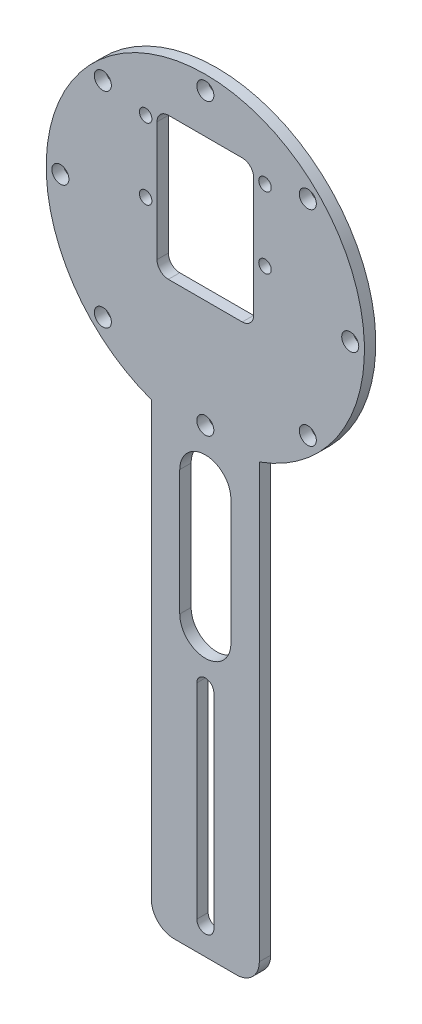
ISO-10303-21;
HEADER;
FILE_DESCRIPTION(('STEP AP214'),'2;1');
FILE_NAME('part.step','',(''),(''),'','','');
FILE_SCHEMA(('AUTOMOTIVE_DESIGN { 1 0 10303 214 1 1 1 1 }'));
ENDSEC;
DATA;
#1=APPLICATION_CONTEXT('core data for automotive mechanical design processes');
#2=APPLICATION_PROTOCOL_DEFINITION('international standard','automotive_design',2000,#1);
#3=PRODUCT_CONTEXT('',#1,'mechanical');
#4=PRODUCT('Part','Part','',(#3));
#5=PRODUCT_RELATED_PRODUCT_CATEGORY('part','',(#4));
#6=PRODUCT_DEFINITION_FORMATION('','',#4);
#7=PRODUCT_DEFINITION_CONTEXT('part definition',#1,'design');
#8=PRODUCT_DEFINITION('design','',#6,#7);
#9=PRODUCT_DEFINITION_SHAPE('','',#8);
#10=(LENGTH_UNIT() NAMED_UNIT(*) SI_UNIT(.MILLI.,.METRE.));
#11=(NAMED_UNIT(*) PLANE_ANGLE_UNIT() SI_UNIT($,.RADIAN.));
#12=(NAMED_UNIT(*) SI_UNIT($,.STERADIAN.) SOLID_ANGLE_UNIT());
#13=UNCERTAINTY_MEASURE_WITH_UNIT(LENGTH_MEASURE(1.E-05),#10,'distance_accuracy_value','');
#14=(GEOMETRIC_REPRESENTATION_CONTEXT(3) GLOBAL_UNCERTAINTY_ASSIGNED_CONTEXT((#13)) GLOBAL_UNIT_ASSIGNED_CONTEXT((#10,
#11,#12)) REPRESENTATION_CONTEXT('',''));
#15=CARTESIAN_POINT('',(0.,0.,0.));
#16=DIRECTION('',(0.,0.,1.));
#17=DIRECTION('',(1.,0.,0.));
#18=AXIS2_PLACEMENT_3D('',#15,#16,#17);
#19=CARTESIAN_POINT('',(0.,106.5,2.));
#20=DIRECTION('',(0.,0.,1.));
#21=DIRECTION('',(1.,0.,0.));
#22=AXIS2_PLACEMENT_3D('',#19,#20,#21);
#23=PLANE('',#22);
#24=CARTESIAN_POINT('',(0.,41.,2.));
#25=DIRECTION('',(0.,0.,1.));
#26=DIRECTION('',(1.,0.,0.));
#27=AXIS2_PLACEMENT_3D('',#24,#25,#26);
#28=CIRCLE('',#27,1.5);
#29=CARTESIAN_POINT('',(1.5,41.,2.));
#30=VERTEX_POINT('',#29);
#31=CARTESIAN_POINT('',(-1.5,41.,2.));
#32=VERTEX_POINT('',#31);
#33=EDGE_CURVE('E191',#30,#32,#28,.T.);
#34=ORIENTED_EDGE('',*,*,#33,.F.);
#35=DIRECTION('',(0.,1.,0.));
#36=VECTOR('',#35,1.);
#37=CARTESIAN_POINT('',(1.5,41.,2.));
#38=LINE('',#37,#36);
#39=CARTESIAN_POINT('',(1.5,5.,2.));
#40=VERTEX_POINT('',#39);
#41=EDGE_CURVE('E209',#40,#30,#38,.T.);
#42=ORIENTED_EDGE('',*,*,#41,.F.);
#43=CARTESIAN_POINT('',(0.,5.,2.));
#44=DIRECTION('',(0.,0.,1.));
#45=DIRECTION('',(1.,0.,0.));
#46=AXIS2_PLACEMENT_3D('',#43,#44,#45);
#47=CIRCLE('',#46,1.5);
#48=CARTESIAN_POINT('',(-1.5,5.,2.));
#49=VERTEX_POINT('',#48);
#50=EDGE_CURVE('E212',#49,#40,#47,.T.);
#51=ORIENTED_EDGE('',*,*,#50,.F.);
#52=DIRECTION('',(0.,-1.,0.));
#53=VECTOR('',#52,1.);
#54=CARTESIAN_POINT('',(-1.5,41.,2.));
#55=LINE('',#54,#53);
#56=EDGE_CURVE('E218',#32,#49,#55,.T.);
#57=ORIENTED_EDGE('',*,*,#56,.F.);
#58=EDGE_LOOP('',(#34,#42,#51,#57));
#59=FACE_BOUND('',#58,.T.);
#60=CARTESIAN_POINT('',(0.,72.,2.));
#61=DIRECTION('',(0.,0.,1.));
#62=DIRECTION('',(1.,0.,0.));
#63=AXIS2_PLACEMENT_3D('',#60,#61,#62);
#64=CIRCLE('',#63,4.50000000000001);
#65=CARTESIAN_POINT('',(4.50000000000001,72.,2.));
#66=VERTEX_POINT('',#65);
#67=CARTESIAN_POINT('',(-4.50000000000001,72.,2.));
#68=VERTEX_POINT('',#67);
#69=EDGE_CURVE('E224',#66,#68,#64,.T.);
#70=ORIENTED_EDGE('',*,*,#69,.F.);
#71=DIRECTION('',(0.,1.,0.));
#72=VECTOR('',#71,1.);
#73=CARTESIAN_POINT('',(4.50000000000001,72.,2.));
#74=LINE('',#73,#72);
#75=CARTESIAN_POINT('',(4.50000000000002,50.,2.));
#76=VERTEX_POINT('',#75);
#77=EDGE_CURVE('E232',#76,#66,#74,.T.);
#78=ORIENTED_EDGE('',*,*,#77,.F.);
#79=CARTESIAN_POINT('',(0.,50.,2.));
#80=DIRECTION('',(0.,0.,1.));
#81=DIRECTION('',(1.,0.,0.));
#82=AXIS2_PLACEMENT_3D('',#79,#80,#81);
#83=CIRCLE('',#82,4.50000000000001);
#84=CARTESIAN_POINT('',(-4.50000000000001,50.,2.));
#85=VERTEX_POINT('',#84);
#86=EDGE_CURVE('E246',#85,#76,#83,.T.);
#87=ORIENTED_EDGE('',*,*,#86,.F.);
#88=DIRECTION('',(0.,-1.,0.));
#89=VECTOR('',#88,1.);
#90=CARTESIAN_POINT('',(-4.50000000000001,72.,2.));
#91=LINE('',#90,#89);
#92=EDGE_CURVE('E243',#68,#85,#91,.T.);
#93=ORIENTED_EDGE('',*,*,#92,.F.);
#94=EDGE_LOOP('',(#70,#78,#87,#93));
#95=FACE_BOUND('',#94,.T.);
#96=CARTESIAN_POINT('',(-25.4999999999993,106.499999999999,2.));
#97=DIRECTION('',(0.,0.,1.));
#98=DIRECTION('',(1.,0.,0.));
#99=AXIS2_PLACEMENT_3D('',#96,#97,#98);
#100=CIRCLE('',#99,1.49999999999999);
#101=CARTESIAN_POINT('',(-23.9999999999993,106.499999999999,2.));
#102=VERTEX_POINT('',#101);
#103=EDGE_CURVE('E266',#102,#102,#100,.T.);
#104=ORIENTED_EDGE('',*,*,#103,.F.);
#105=EDGE_LOOP('',(#104));
#106=FACE_BOUND('',#105,.T.);
#107=CARTESIAN_POINT('',(1.38678545745389E-12,81.,2.));
#108=DIRECTION('',(0.,0.,1.));
#109=DIRECTION('',(1.,0.,0.));
#110=AXIS2_PLACEMENT_3D('',#107,#108,#109);
#111=CIRCLE('',#110,1.5);
#112=CARTESIAN_POINT('',(1.50000000000139,81.,2.));
#113=VERTEX_POINT('',#112);
#114=EDGE_CURVE('E278',#113,#113,#111,.T.);
#115=ORIENTED_EDGE('',*,*,#114,.F.);
#116=EDGE_LOOP('',(#115));
#117=FACE_BOUND('',#116,.T.);
#118=CARTESIAN_POINT('',(10.5,123.,2.));
#119=DIRECTION('',(0.,0.,1.));
#120=DIRECTION('',(-1.,0.,0.));
#121=AXIS2_PLACEMENT_3D('',#118,#119,#120);
#122=CIRCLE('',#121,1.10000000000001);
#123=CARTESIAN_POINT('',(9.39999999999999,123.,2.));
#124=VERTEX_POINT('',#123);
#125=EDGE_CURVE('E290',#124,#124,#122,.T.);
#126=ORIENTED_EDGE('',*,*,#125,.F.);
#127=EDGE_LOOP('',(#126));
#128=FACE_BOUND('',#127,.T.);
#129=CARTESIAN_POINT('',(-10.5,110.5,2.));
#130=DIRECTION('',(0.,0.,1.));
#131=DIRECTION('',(1.,0.,0.));
#132=AXIS2_PLACEMENT_3D('',#129,#130,#131);
#133=CIRCLE('',#132,1.10000000000001);
#134=CARTESIAN_POINT('',(-9.39999999999999,110.5,2.));
#135=VERTEX_POINT('',#134);
#136=EDGE_CURVE('E302',#135,#135,#133,.T.);
#137=ORIENTED_EDGE('',*,*,#136,.F.);
#138=EDGE_LOOP('',(#137));
#139=FACE_BOUND('',#138,.T.);
#140=CARTESIAN_POINT('',(25.5000000000007,106.500000000001,2.));
#141=DIRECTION('',(0.,0.,1.));
#142=DIRECTION('',(1.,0.,0.));
#143=AXIS2_PLACEMENT_3D('',#140,#141,#142);
#144=CIRCLE('',#143,1.5);
#145=CARTESIAN_POINT('',(27.0000000000007,106.500000000001,2.));
#146=VERTEX_POINT('',#145);
#147=EDGE_CURVE('E314',#146,#146,#144,.T.);
#148=ORIENTED_EDGE('',*,*,#147,.F.);
#149=EDGE_LOOP('',(#148));
#150=FACE_BOUND('',#149,.T.);
#151=CARTESIAN_POINT('',(0.,132.,2.));
#152=DIRECTION('',(0.,0.,1.));
#153=DIRECTION('',(1.,0.,0.));
#154=AXIS2_PLACEMENT_3D('',#151,#152,#153);
#155=CIRCLE('',#154,1.5);
#156=CARTESIAN_POINT('',(1.5,132.,2.));
#157=VERTEX_POINT('',#156);
#158=EDGE_CURVE('E326',#157,#157,#155,.T.);
#159=ORIENTED_EDGE('',*,*,#158,.F.);
#160=EDGE_LOOP('',(#159));
#161=FACE_BOUND('',#160,.T.);
#162=DIRECTION('',(0.,-1.,0.));
#163=VECTOR('',#162,1.);
#164=CARTESIAN_POINT('',(-9.5,80.1608656178682,2.));
#165=LINE('',#164,#163);
#166=CARTESIAN_POINT('',(-9.5,80.1608656178682,2.));
#167=VERTEX_POINT('',#166);
#168=CARTESIAN_POINT('',(-9.50000000000001,4.,2.));
#169=VERTEX_POINT('',#168);
#170=EDGE_CURVE('E359',#167,#169,#165,.T.);
#171=ORIENTED_EDGE('',*,*,#170,.T.);
#172=CARTESIAN_POINT('',(-5.50000000000001,4.,2.));
#173=DIRECTION('',(0.,0.,1.));
#174=DIRECTION('',(1.,0.,0.));
#175=AXIS2_PLACEMENT_3D('',#172,#173,#174);
#176=CIRCLE('',#175,4.);
#177=CARTESIAN_POINT('',(-5.50000000000001,0.,2.));
#178=VERTEX_POINT('',#177);
#179=EDGE_CURVE('E41',#169,#178,#176,.T.);
#180=ORIENTED_EDGE('',*,*,#179,.T.);
#181=DIRECTION('',(1.,0.,0.));
#182=VECTOR('',#181,1.);
#183=CARTESIAN_POINT('',(9.50000000000001,0.,2.));
#184=LINE('',#183,#182);
#185=CARTESIAN_POINT('',(5.50000000000001,0.,2.));
#186=VERTEX_POINT('',#185);
#187=EDGE_CURVE('E362',#178,#186,#184,.T.);
#188=ORIENTED_EDGE('',*,*,#187,.T.);
#189=CARTESIAN_POINT('',(5.50000000000001,4.,2.));
#190=DIRECTION('',(0.,0.,1.));
#191=DIRECTION('',(1.,0.,0.));
#192=AXIS2_PLACEMENT_3D('',#189,#190,#191);
#193=CIRCLE('',#192,4.);
#194=CARTESIAN_POINT('',(9.50000000000001,4.,2.));
#195=VERTEX_POINT('',#194);
#196=EDGE_CURVE('E48',#186,#195,#193,.T.);
#197=ORIENTED_EDGE('',*,*,#196,.T.);
#198=DIRECTION('',(0.,1.,0.));
#199=VECTOR('',#198,1.);
#200=CARTESIAN_POINT('',(9.5,80.1608656178682,2.));
#201=LINE('',#200,#199);
#202=CARTESIAN_POINT('',(9.5,80.1608656178682,2.));
#203=VERTEX_POINT('',#202);
#204=EDGE_CURVE('E364',#195,#203,#201,.T.);
#205=ORIENTED_EDGE('',*,*,#204,.T.);
#206=CARTESIAN_POINT('',(0.,106.5,2.));
#207=DIRECTION('',(0.,0.,1.));
#208=DIRECTION('',(1.,0.,0.));
#209=AXIS2_PLACEMENT_3D('',#206,#207,#208);
#210=CIRCLE('',#209,28.);
#211=EDGE_CURVE('E356',#203,#167,#210,.T.);
#212=ORIENTED_EDGE('',*,*,#211,.T.);
#213=EDGE_LOOP('',(#171,#180,#188,#197,#205,#212));
#214=FACE_BOUND('',#213,.T.);
#215=DIRECTION('',(1.,0.,0.));
#216=VECTOR('',#215,1.);
#217=CARTESIAN_POINT('',(8.5,100.,2.));
#218=LINE('',#217,#216);
#219=CARTESIAN_POINT('',(-6.5,100.,2.));
#220=VERTEX_POINT('',#219);
#221=CARTESIAN_POINT('',(6.5,100.,2.));
#222=VERTEX_POINT('',#221);
#223=EDGE_CURVE('E335',#220,#222,#218,.T.);
#224=ORIENTED_EDGE('',*,*,#223,.F.);
#225=CARTESIAN_POINT('',(-6.5,102.,2.));
#226=DIRECTION('',(0.,0.,1.));
#227=DIRECTION('',(1.,0.,0.));
#228=AXIS2_PLACEMENT_3D('',#225,#226,#227);
#229=CIRCLE('',#228,2.);
#230=CARTESIAN_POINT('',(-8.5,102.,2.));
#231=VERTEX_POINT('',#230);
#232=EDGE_CURVE('E410',#220,#231,#229,.F.);
#233=ORIENTED_EDGE('',*,*,#232,.T.);
#234=DIRECTION('',(0.,-1.,0.));
#235=VECTOR('',#234,1.);
#236=CARTESIAN_POINT('',(-8.5,100.,2.));
#237=LINE('',#236,#235);
#238=CARTESIAN_POINT('',(-8.5,123.,2.));
#239=VERTEX_POINT('',#238);
#240=EDGE_CURVE('E332',#239,#231,#237,.T.);
#241=ORIENTED_EDGE('',*,*,#240,.F.);
#242=CARTESIAN_POINT('',(-6.5,123.,2.));
#243=DIRECTION('',(0.,0.,1.));
#244=DIRECTION('',(1.,0.,0.));
#245=AXIS2_PLACEMENT_3D('',#242,#243,#244);
#246=CIRCLE('',#245,2.);
#247=CARTESIAN_POINT('',(-6.5,125.,2.));
#248=VERTEX_POINT('',#247);
#249=EDGE_CURVE('E406',#239,#248,#246,.F.);
#250=ORIENTED_EDGE('',*,*,#249,.T.);
#251=DIRECTION('',(-1.,0.,0.));
#252=VECTOR('',#251,1.);
#253=CARTESIAN_POINT('',(-8.5,125.,2.));
#254=LINE('',#253,#252);
#255=CARTESIAN_POINT('',(6.5,125.,2.));
#256=VERTEX_POINT('',#255);
#257=EDGE_CURVE('E342',#256,#248,#254,.T.);
#258=ORIENTED_EDGE('',*,*,#257,.F.);
#259=CARTESIAN_POINT('',(6.5,123.,2.));
#260=DIRECTION('',(0.,0.,1.));
#261=DIRECTION('',(1.,0.,0.));
#262=AXIS2_PLACEMENT_3D('',#259,#260,#261);
#263=CIRCLE('',#262,2.);
#264=CARTESIAN_POINT('',(8.5,123.,2.));
#265=VERTEX_POINT('',#264);
#266=EDGE_CURVE('E402',#256,#265,#263,.F.);
#267=ORIENTED_EDGE('',*,*,#266,.T.);
#268=DIRECTION('',(0.,1.,0.));
#269=VECTOR('',#268,1.);
#270=CARTESIAN_POINT('',(8.5,100.,2.));
#271=LINE('',#270,#269);
#272=CARTESIAN_POINT('',(8.5,102.,2.));
#273=VERTEX_POINT('',#272);
#274=EDGE_CURVE('E339',#273,#265,#271,.T.);
#275=ORIENTED_EDGE('',*,*,#274,.F.);
#276=CARTESIAN_POINT('',(6.5,102.,2.));
#277=DIRECTION('',(0.,0.,1.));
#278=DIRECTION('',(1.,0.,0.));
#279=AXIS2_PLACEMENT_3D('',#276,#277,#278);
#280=CIRCLE('',#279,2.);
#281=EDGE_CURVE('E414',#273,#222,#280,.F.);
#282=ORIENTED_EDGE('',*,*,#281,.T.);
#283=EDGE_LOOP('',(#224,#233,#241,#250,#258,#267,#275,#282));
#284=FACE_BOUND('',#283,.T.);
#285=CARTESIAN_POINT('',(18.0312229202572,124.531222920257,2.));
#286=DIRECTION('',(0.,0.,1.));
#287=DIRECTION('',(1.,0.,0.));
#288=AXIS2_PLACEMENT_3D('',#285,#286,#287);
#289=CIRCLE('',#288,1.50000000000001);
#290=CARTESIAN_POINT('',(19.5312229202572,124.531222920257,2.));
#291=VERTEX_POINT('',#290);
#292=EDGE_CURVE('E320',#291,#291,#289,.T.);
#293=ORIENTED_EDGE('',*,*,#292,.F.);
#294=EDGE_LOOP('',(#293));
#295=FACE_BOUND('',#294,.T.);
#296=CARTESIAN_POINT('',(-10.5,123.,2.));
#297=DIRECTION('',(0.,0.,1.));
#298=DIRECTION('',(1.,0.,0.));
#299=AXIS2_PLACEMENT_3D('',#296,#297,#298);
#300=CIRCLE('',#299,1.10000000000001);
#301=CARTESIAN_POINT('',(-9.39999999999999,123.,2.));
#302=VERTEX_POINT('',#301);
#303=EDGE_CURVE('E308',#302,#302,#300,.T.);
#304=ORIENTED_EDGE('',*,*,#303,.F.);
#305=EDGE_LOOP('',(#304));
#306=FACE_BOUND('',#305,.T.);
#307=CARTESIAN_POINT('',(10.5,110.5,2.));
#308=DIRECTION('',(0.,0.,1.));
#309=DIRECTION('',(-1.,0.,0.));
#310=AXIS2_PLACEMENT_3D('',#307,#308,#309);
#311=CIRCLE('',#310,1.10000000000001);
#312=CARTESIAN_POINT('',(9.39999999999999,110.5,2.));
#313=VERTEX_POINT('',#312);
#314=EDGE_CURVE('E296',#313,#313,#311,.T.);
#315=ORIENTED_EDGE('',*,*,#314,.F.);
#316=EDGE_LOOP('',(#315));
#317=FACE_BOUND('',#316,.T.);
#318=CARTESIAN_POINT('',(18.0312229202581,88.4687770797435,2.));
#319=DIRECTION('',(0.,0.,1.));
#320=DIRECTION('',(1.,0.,0.));
#321=AXIS2_PLACEMENT_3D('',#318,#319,#320);
#322=CIRCLE('',#321,1.5);
#323=CARTESIAN_POINT('',(19.5312229202581,88.4687770797435,2.));
#324=VERTEX_POINT('',#323);
#325=EDGE_CURVE('E284',#324,#324,#322,.T.);
#326=ORIENTED_EDGE('',*,*,#325,.F.);
#327=EDGE_LOOP('',(#326));
#328=FACE_BOUND('',#327,.T.);
#329=CARTESIAN_POINT('',(-18.0312229202558,88.4687770797425,2.));
#330=DIRECTION('',(0.,0.,1.));
#331=DIRECTION('',(1.,0.,0.));
#332=AXIS2_PLACEMENT_3D('',#329,#330,#331);
#333=CIRCLE('',#332,1.5);
#334=CARTESIAN_POINT('',(-16.5312229202558,88.4687770797425,2.));
#335=VERTEX_POINT('',#334);
#336=EDGE_CURVE('E272',#335,#335,#333,.T.);
#337=ORIENTED_EDGE('',*,*,#336,.F.);
#338=EDGE_LOOP('',(#337));
#339=FACE_BOUND('',#338,.T.);
#340=CARTESIAN_POINT('',(-18.0312229202568,124.531222920256,2.));
#341=DIRECTION('',(0.,0.,1.));
#342=DIRECTION('',(1.,0.,0.));
#343=AXIS2_PLACEMENT_3D('',#340,#341,#342);
#344=CIRCLE('',#343,1.5);
#345=CARTESIAN_POINT('',(-16.5312229202568,124.531222920256,2.));
#346=VERTEX_POINT('',#345);
#347=EDGE_CURVE('E260',#346,#346,#344,.T.);
#348=ORIENTED_EDGE('',*,*,#347,.F.);
#349=EDGE_LOOP('',(#348));
#350=FACE_BOUND('',#349,.T.);
#351=ADVANCED_FACE('F33',(#59,#95,#106,#117,#128,#139,#150,#161,#214,#284,#295,#306,#317,#328,
#339,#350),#23,.T.);
#352=CARTESIAN_POINT('',(0.,106.5,0.));
#353=DIRECTION('',(0.,0.,1.));
#354=DIRECTION('',(1.,0.,0.));
#355=AXIS2_PLACEMENT_3D('',#352,#353,#354);
#356=PLANE('',#355);
#357=DIRECTION('',(0.,1.,0.));
#358=VECTOR('',#357,1.);
#359=CARTESIAN_POINT('',(1.5,41.,0.));
#360=LINE('',#359,#358);
#361=CARTESIAN_POINT('',(1.5,5.,0.));
#362=VERTEX_POINT('',#361);
#363=CARTESIAN_POINT('',(1.5,41.,0.));
#364=VERTEX_POINT('',#363);
#365=EDGE_CURVE('E196',#362,#364,#360,.T.);
#366=ORIENTED_EDGE('',*,*,#365,.T.);
#367=CARTESIAN_POINT('',(0.,41.,0.));
#368=DIRECTION('',(0.,0.,1.));
#369=DIRECTION('',(1.,0.,0.));
#370=AXIS2_PLACEMENT_3D('',#367,#368,#369);
#371=CIRCLE('',#370,1.5);
#372=CARTESIAN_POINT('',(-1.5,41.,0.));
#373=VERTEX_POINT('',#372);
#374=EDGE_CURVE('E188',#364,#373,#371,.T.);
#375=ORIENTED_EDGE('',*,*,#374,.T.);
#376=DIRECTION('',(0.,-1.,0.));
#377=VECTOR('',#376,1.);
#378=CARTESIAN_POINT('',(-1.5,41.,0.));
#379=LINE('',#378,#377);
#380=CARTESIAN_POINT('',(-1.5,5.,0.));
#381=VERTEX_POINT('',#380);
#382=EDGE_CURVE('E200',#373,#381,#379,.T.);
#383=ORIENTED_EDGE('',*,*,#382,.T.);
#384=CARTESIAN_POINT('',(0.,5.,0.));
#385=DIRECTION('',(0.,0.,1.));
#386=DIRECTION('',(1.,0.,0.));
#387=AXIS2_PLACEMENT_3D('',#384,#385,#386);
#388=CIRCLE('',#387,1.5);
#389=EDGE_CURVE('E204',#381,#362,#388,.T.);
#390=ORIENTED_EDGE('',*,*,#389,.T.);
#391=EDGE_LOOP('',(#366,#375,#383,#390));
#392=FACE_BOUND('',#391,.T.);
#393=DIRECTION('',(0.,1.,0.));
#394=VECTOR('',#393,1.);
#395=CARTESIAN_POINT('',(4.50000000000001,72.,0.));
#396=LINE('',#395,#394);
#397=CARTESIAN_POINT('',(4.50000000000002,50.,0.));
#398=VERTEX_POINT('',#397);
#399=CARTESIAN_POINT('',(4.50000000000001,72.,0.));
#400=VERTEX_POINT('',#399);
#401=EDGE_CURVE('E238',#398,#400,#396,.T.);
#402=ORIENTED_EDGE('',*,*,#401,.T.);
#403=CARTESIAN_POINT('',(0.,72.,0.));
#404=DIRECTION('',(0.,0.,1.));
#405=DIRECTION('',(1.,0.,0.));
#406=AXIS2_PLACEMENT_3D('',#403,#404,#405);
#407=CIRCLE('',#406,4.50000000000001);
#408=CARTESIAN_POINT('',(-4.50000000000001,72.,0.));
#409=VERTEX_POINT('',#408);
#410=EDGE_CURVE('E228',#400,#409,#407,.T.);
#411=ORIENTED_EDGE('',*,*,#410,.T.);
#412=DIRECTION('',(0.,-1.,0.));
#413=VECTOR('',#412,1.);
#414=CARTESIAN_POINT('',(-4.50000000000001,72.,0.));
#415=LINE('',#414,#413);
#416=CARTESIAN_POINT('',(-4.50000000000001,50.,0.));
#417=VERTEX_POINT('',#416);
#418=EDGE_CURVE('E231',#409,#417,#415,.T.);
#419=ORIENTED_EDGE('',*,*,#418,.T.);
#420=CARTESIAN_POINT('',(0.,50.,0.));
#421=DIRECTION('',(0.,0.,1.));
#422=DIRECTION('',(1.,0.,0.));
#423=AXIS2_PLACEMENT_3D('',#420,#421,#422);
#424=CIRCLE('',#423,4.50000000000001);
#425=EDGE_CURVE('E235',#417,#398,#424,.T.);
#426=ORIENTED_EDGE('',*,*,#425,.T.);
#427=EDGE_LOOP('',(#402,#411,#419,#426));
#428=FACE_BOUND('',#427,.T.);
#429=DIRECTION('',(1.,0.,0.));
#430=VECTOR('',#429,1.);
#431=CARTESIAN_POINT('',(9.50000000000001,0.,0.));
#432=LINE('',#431,#430);
#433=CARTESIAN_POINT('',(-5.50000000000001,0.,0.));
#434=VERTEX_POINT('',#433);
#435=CARTESIAN_POINT('',(5.50000000000001,0.,0.));
#436=VERTEX_POINT('',#435);
#437=EDGE_CURVE('E371',#434,#436,#432,.T.);
#438=ORIENTED_EDGE('',*,*,#437,.F.);
#439=CARTESIAN_POINT('',(-5.50000000000001,4.,0.));
#440=DIRECTION('',(0.,0.,1.));
#441=DIRECTION('',(1.,0.,0.));
#442=AXIS2_PLACEMENT_3D('',#439,#440,#441);
#443=CIRCLE('',#442,4.);
#444=CARTESIAN_POINT('',(-9.50000000000001,4.,0.));
#445=VERTEX_POINT('',#444);
#446=EDGE_CURVE('E423',#434,#445,#443,.F.);
#447=ORIENTED_EDGE('',*,*,#446,.T.);
#448=DIRECTION('',(0.,-1.,0.));
#449=VECTOR('',#448,1.);
#450=CARTESIAN_POINT('',(-9.5,80.1608656178682,0.));
#451=LINE('',#450,#449);
#452=CARTESIAN_POINT('',(-9.5,80.1608656178682,0.));
#453=VERTEX_POINT('',#452);
#454=EDGE_CURVE('E369',#453,#445,#451,.T.);
#455=ORIENTED_EDGE('',*,*,#454,.F.);
#456=CARTESIAN_POINT('',(0.,106.5,0.));
#457=DIRECTION('',(0.,0.,1.));
#458=DIRECTION('',(1.,0.,0.));
#459=AXIS2_PLACEMENT_3D('',#456,#457,#458);
#460=CIRCLE('',#459,28.);
#461=CARTESIAN_POINT('',(9.5,80.1608656178682,0.));
#462=VERTEX_POINT('',#461);
#463=EDGE_CURVE('E345',#462,#453,#460,.T.);
#464=ORIENTED_EDGE('',*,*,#463,.F.);
#465=DIRECTION('',(0.,1.,0.));
#466=VECTOR('',#465,1.);
#467=CARTESIAN_POINT('',(9.5,80.1608656178682,0.));
#468=LINE('',#467,#466);
#469=CARTESIAN_POINT('',(9.50000000000001,4.,0.));
#470=VERTEX_POINT('',#469);
#471=EDGE_CURVE('E360',#470,#462,#468,.T.);
#472=ORIENTED_EDGE('',*,*,#471,.F.);
#473=CARTESIAN_POINT('',(5.50000000000001,4.,0.));
#474=DIRECTION('',(0.,0.,1.));
#475=DIRECTION('',(1.,0.,0.));
#476=AXIS2_PLACEMENT_3D('',#473,#474,#475);
#477=CIRCLE('',#476,4.);
#478=EDGE_CURVE('E421',#470,#436,#477,.F.);
#479=ORIENTED_EDGE('',*,*,#478,.T.);
#480=EDGE_LOOP('',(#438,#447,#455,#464,#472,#479));
#481=FACE_BOUND('',#480,.T.);
#482=DIRECTION('',(-1.,0.,0.));
#483=VECTOR('',#482,1.);
#484=CARTESIAN_POINT('',(-8.5,125.,0.));
#485=LINE('',#484,#483);
#486=CARTESIAN_POINT('',(6.5,125.,0.));
#487=VERTEX_POINT('',#486);
#488=CARTESIAN_POINT('',(-6.5,125.,0.));
#489=VERTEX_POINT('',#488);
#490=EDGE_CURVE('E336',#487,#489,#485,.T.);
#491=ORIENTED_EDGE('',*,*,#490,.T.);
#492=CARTESIAN_POINT('',(-6.5,123.,0.));
#493=DIRECTION('',(0.,0.,1.));
#494=DIRECTION('',(1.,0.,0.));
#495=AXIS2_PLACEMENT_3D('',#492,#493,#494);
#496=CIRCLE('',#495,2.);
#497=CARTESIAN_POINT('',(-8.5,123.,0.));
#498=VERTEX_POINT('',#497);
#499=EDGE_CURVE('E404',#489,#498,#496,.T.);
#500=ORIENTED_EDGE('',*,*,#499,.T.);
#501=DIRECTION('',(0.,-1.,0.));
#502=VECTOR('',#501,1.);
#503=CARTESIAN_POINT('',(-8.5,100.,0.));
#504=LINE('',#503,#502);
#505=CARTESIAN_POINT('',(-8.5,102.,0.));
#506=VERTEX_POINT('',#505);
#507=EDGE_CURVE('E329',#498,#506,#504,.T.);
#508=ORIENTED_EDGE('',*,*,#507,.T.);
#509=CARTESIAN_POINT('',(-6.5,102.,0.));
#510=DIRECTION('',(0.,0.,1.));
#511=DIRECTION('',(1.,0.,0.));
#512=AXIS2_PLACEMENT_3D('',#509,#510,#511);
#513=CIRCLE('',#512,2.);
#514=CARTESIAN_POINT('',(-6.5,100.,0.));
#515=VERTEX_POINT('',#514);
#516=EDGE_CURVE('E408',#506,#515,#513,.T.);
#517=ORIENTED_EDGE('',*,*,#516,.T.);
#518=DIRECTION('',(1.,0.,0.));
#519=VECTOR('',#518,1.);
#520=CARTESIAN_POINT('',(8.5,100.,0.));
#521=LINE('',#520,#519);
#522=CARTESIAN_POINT('',(6.5,100.,0.));
#523=VERTEX_POINT('',#522);
#524=EDGE_CURVE('E348',#515,#523,#521,.T.);
#525=ORIENTED_EDGE('',*,*,#524,.T.);
#526=CARTESIAN_POINT('',(6.5,102.,0.));
#527=DIRECTION('',(0.,0.,1.));
#528=DIRECTION('',(1.,0.,0.));
#529=AXIS2_PLACEMENT_3D('',#526,#527,#528);
#530=CIRCLE('',#529,2.);
#531=CARTESIAN_POINT('',(8.5,102.,0.));
#532=VERTEX_POINT('',#531);
#533=EDGE_CURVE('E412',#523,#532,#530,.T.);
#534=ORIENTED_EDGE('',*,*,#533,.T.);
#535=DIRECTION('',(0.,1.,0.));
#536=VECTOR('',#535,1.);
#537=CARTESIAN_POINT('',(8.5,100.,0.));
#538=LINE('',#537,#536);
#539=CARTESIAN_POINT('',(8.5,123.,0.));
#540=VERTEX_POINT('',#539);
#541=EDGE_CURVE('E351',#532,#540,#538,.T.);
#542=ORIENTED_EDGE('',*,*,#541,.T.);
#543=CARTESIAN_POINT('',(6.5,123.,0.));
#544=DIRECTION('',(0.,0.,1.));
#545=DIRECTION('',(1.,0.,0.));
#546=AXIS2_PLACEMENT_3D('',#543,#544,#545);
#547=CIRCLE('',#546,2.);
#548=EDGE_CURVE('E400',#540,#487,#547,.T.);
#549=ORIENTED_EDGE('',*,*,#548,.T.);
#550=EDGE_LOOP('',(#491,#500,#508,#517,#525,#534,#542,#549));
#551=FACE_BOUND('',#550,.T.);
#552=CARTESIAN_POINT('',(0.,132.,0.));
#553=DIRECTION('',(0.,0.,1.));
#554=DIRECTION('',(1.,0.,0.));
#555=AXIS2_PLACEMENT_3D('',#552,#553,#554);
#556=CIRCLE('',#555,1.5);
#557=CARTESIAN_POINT('',(1.5,132.,0.));
#558=VERTEX_POINT('',#557);
#559=EDGE_CURVE('E323',#558,#558,#556,.T.);
#560=ORIENTED_EDGE('',*,*,#559,.T.);
#561=EDGE_LOOP('',(#560));
#562=FACE_BOUND('',#561,.T.);
#563=CARTESIAN_POINT('',(18.0312229202572,124.531222920257,0.));
#564=DIRECTION('',(0.,0.,1.));
#565=DIRECTION('',(1.,0.,0.));
#566=AXIS2_PLACEMENT_3D('',#563,#564,#565);
#567=CIRCLE('',#566,1.50000000000001);
#568=CARTESIAN_POINT('',(19.5312229202572,124.531222920257,0.));
#569=VERTEX_POINT('',#568);
#570=EDGE_CURVE('E317',#569,#569,#567,.T.);
#571=ORIENTED_EDGE('',*,*,#570,.T.);
#572=EDGE_LOOP('',(#571));
#573=FACE_BOUND('',#572,.T.);
#574=CARTESIAN_POINT('',(25.5000000000007,106.500000000001,0.));
#575=DIRECTION('',(0.,0.,1.));
#576=DIRECTION('',(1.,0.,0.));
#577=AXIS2_PLACEMENT_3D('',#574,#575,#576);
#578=CIRCLE('',#577,1.5);
#579=CARTESIAN_POINT('',(27.0000000000007,106.500000000001,0.));
#580=VERTEX_POINT('',#579);
#581=EDGE_CURVE('E311',#580,#580,#578,.T.);
#582=ORIENTED_EDGE('',*,*,#581,.T.);
#583=EDGE_LOOP('',(#582));
#584=FACE_BOUND('',#583,.T.);
#585=CARTESIAN_POINT('',(-10.5,123.,0.));
#586=DIRECTION('',(0.,0.,1.));
#587=DIRECTION('',(1.,0.,0.));
#588=AXIS2_PLACEMENT_3D('',#585,#586,#587);
#589=CIRCLE('',#588,1.10000000000001);
#590=CARTESIAN_POINT('',(-9.39999999999999,123.,0.));
#591=VERTEX_POINT('',#590);
#592=EDGE_CURVE('E305',#591,#591,#589,.T.);
#593=ORIENTED_EDGE('',*,*,#592,.T.);
#594=EDGE_LOOP('',(#593));
#595=FACE_BOUND('',#594,.T.);
#596=CARTESIAN_POINT('',(-10.5,110.5,0.));
#597=DIRECTION('',(0.,0.,1.));
#598=DIRECTION('',(1.,0.,0.));
#599=AXIS2_PLACEMENT_3D('',#596,#597,#598);
#600=CIRCLE('',#599,1.10000000000001);
#601=CARTESIAN_POINT('',(-9.39999999999999,110.5,0.));
#602=VERTEX_POINT('',#601);
#603=EDGE_CURVE('E299',#602,#602,#600,.T.);
#604=ORIENTED_EDGE('',*,*,#603,.T.);
#605=EDGE_LOOP('',(#604));
#606=FACE_BOUND('',#605,.T.);
#607=CARTESIAN_POINT('',(10.5,110.5,0.));
#608=DIRECTION('',(0.,0.,1.));
#609=DIRECTION('',(-1.,0.,0.));
#610=AXIS2_PLACEMENT_3D('',#607,#608,#609);
#611=CIRCLE('',#610,1.10000000000001);
#612=CARTESIAN_POINT('',(9.39999999999999,110.5,0.));
#613=VERTEX_POINT('',#612);
#614=EDGE_CURVE('E293',#613,#613,#611,.T.);
#615=ORIENTED_EDGE('',*,*,#614,.T.);
#616=EDGE_LOOP('',(#615));
#617=FACE_BOUND('',#616,.T.);
#618=CARTESIAN_POINT('',(10.5,123.,0.));
#619=DIRECTION('',(0.,0.,1.));
#620=DIRECTION('',(-1.,0.,0.));
#621=AXIS2_PLACEMENT_3D('',#618,#619,#620);
#622=CIRCLE('',#621,1.10000000000001);
#623=CARTESIAN_POINT('',(9.39999999999999,123.,0.));
#624=VERTEX_POINT('',#623);
#625=EDGE_CURVE('E287',#624,#624,#622,.T.);
#626=ORIENTED_EDGE('',*,*,#625,.T.);
#627=EDGE_LOOP('',(#626));
#628=FACE_BOUND('',#627,.T.);
#629=CARTESIAN_POINT('',(18.0312229202581,88.4687770797435,0.));
#630=DIRECTION('',(0.,0.,1.));
#631=DIRECTION('',(1.,0.,0.));
#632=AXIS2_PLACEMENT_3D('',#629,#630,#631);
#633=CIRCLE('',#632,1.5);
#634=CARTESIAN_POINT('',(19.5312229202581,88.4687770797435,0.));
#635=VERTEX_POINT('',#634);
#636=EDGE_CURVE('E281',#635,#635,#633,.T.);
#637=ORIENTED_EDGE('',*,*,#636,.T.);
#638=EDGE_LOOP('',(#637));
#639=FACE_BOUND('',#638,.T.);
#640=CARTESIAN_POINT('',(1.38678545745389E-12,81.,0.));
#641=DIRECTION('',(0.,0.,1.));
#642=DIRECTION('',(1.,0.,0.));
#643=AXIS2_PLACEMENT_3D('',#640,#641,#642);
#644=CIRCLE('',#643,1.5);
#645=CARTESIAN_POINT('',(1.50000000000139,81.,0.));
#646=VERTEX_POINT('',#645);
#647=EDGE_CURVE('E275',#646,#646,#644,.T.);
#648=ORIENTED_EDGE('',*,*,#647,.T.);
#649=EDGE_LOOP('',(#648));
#650=FACE_BOUND('',#649,.T.);
#651=CARTESIAN_POINT('',(-18.0312229202558,88.4687770797425,0.));
#652=DIRECTION('',(0.,0.,1.));
#653=DIRECTION('',(1.,0.,0.));
#654=AXIS2_PLACEMENT_3D('',#651,#652,#653);
#655=CIRCLE('',#654,1.5);
#656=CARTESIAN_POINT('',(-16.5312229202558,88.4687770797425,0.));
#657=VERTEX_POINT('',#656);
#658=EDGE_CURVE('E269',#657,#657,#655,.T.);
#659=ORIENTED_EDGE('',*,*,#658,.T.);
#660=EDGE_LOOP('',(#659));
#661=FACE_BOUND('',#660,.T.);
#662=CARTESIAN_POINT('',(-25.4999999999993,106.499999999999,0.));
#663=DIRECTION('',(0.,0.,1.));
#664=DIRECTION('',(1.,0.,0.));
#665=AXIS2_PLACEMENT_3D('',#662,#663,#664);
#666=CIRCLE('',#665,1.49999999999999);
#667=CARTESIAN_POINT('',(-23.9999999999993,106.499999999999,0.));
#668=VERTEX_POINT('',#667);
#669=EDGE_CURVE('E263',#668,#668,#666,.T.);
#670=ORIENTED_EDGE('',*,*,#669,.T.);
#671=EDGE_LOOP('',(#670));
#672=FACE_BOUND('',#671,.T.);
#673=CARTESIAN_POINT('',(-18.0312229202568,124.531222920256,0.));
#674=DIRECTION('',(0.,0.,1.));
#675=DIRECTION('',(1.,0.,0.));
#676=AXIS2_PLACEMENT_3D('',#673,#674,#675);
#677=CIRCLE('',#676,1.5);
#678=CARTESIAN_POINT('',(-16.5312229202568,124.531222920256,0.));
#679=VERTEX_POINT('',#678);
#680=EDGE_CURVE('E253',#679,#679,#677,.T.);
#681=ORIENTED_EDGE('',*,*,#680,.T.);
#682=EDGE_LOOP('',(#681));
#683=FACE_BOUND('',#682,.T.);
#684=ADVANCED_FACE('F206',(#392,#428,#481,#551,#562,#573,#584,#595,#606,#617,#628,#639,#650,
#661,#672,#683),#356,.F.);
#685=CARTESIAN_POINT('',(0.,106.5,2.));
#686=DIRECTION('',(0.,0.,-1.));
#687=DIRECTION('',(-1.,0.,0.));
#688=AXIS2_PLACEMENT_3D('',#685,#686,#687);
#689=CYLINDRICAL_SURFACE('',#688,28.);
#690=ORIENTED_EDGE('',*,*,#463,.T.);
#691=DIRECTION('',(0.,0.,-1.));
#692=VECTOR('',#691,1.);
#693=CARTESIAN_POINT('',(-9.5,80.1608656178682,2.));
#694=LINE('',#693,#692);
#695=EDGE_CURVE('E377',#167,#453,#694,.T.);
#696=ORIENTED_EDGE('',*,*,#695,.F.);
#697=ORIENTED_EDGE('',*,*,#211,.F.);
#698=DIRECTION('',(0.,0.,-1.));
#699=VECTOR('',#698,1.);
#700=CARTESIAN_POINT('',(9.5,80.1608656178682,2.));
#701=LINE('',#700,#699);
#702=EDGE_CURVE('E366',#203,#462,#701,.T.);
#703=ORIENTED_EDGE('',*,*,#702,.T.);
#704=EDGE_LOOP('',(#690,#696,#697,#703));
#705=FACE_BOUND('',#704,.T.);
#706=ADVANCED_FACE('F443',(#705),#689,.T.);
#707=CARTESIAN_POINT('',(-9.5,80.1608656178682,2.));
#708=DIRECTION('',(1.,0.,0.));
#709=DIRECTION('',(0.,1.,0.));
#710=AXIS2_PLACEMENT_3D('',#707,#708,#709);
#711=PLANE('',#710);
#712=ORIENTED_EDGE('',*,*,#454,.T.);
#713=DIRECTION('',(0.,0.,-1.));
#714=VECTOR('',#713,1.);
#715=CARTESIAN_POINT('',(-9.50000000000001,4.,2.));
#716=LINE('',#715,#714);
#717=EDGE_CURVE('E56',#445,#169,#716,.F.);
#718=ORIENTED_EDGE('',*,*,#717,.T.);
#719=ORIENTED_EDGE('',*,*,#170,.F.);
#720=ORIENTED_EDGE('',*,*,#695,.T.);
#721=EDGE_LOOP('',(#712,#718,#719,#720));
#722=FACE_BOUND('',#721,.T.);
#723=ADVANCED_FACE('F439',(#722),#711,.F.);
#724=CARTESIAN_POINT('',(9.50000000000001,0.,2.));
#725=DIRECTION('',(0.,1.,0.));
#726=DIRECTION('',(0.,0.,1.));
#727=AXIS2_PLACEMENT_3D('',#724,#725,#726);
#728=PLANE('',#727);
#729=ORIENTED_EDGE('',*,*,#187,.F.);
#730=DIRECTION('',(0.,0.,-1.));
#731=VECTOR('',#730,1.);
#732=CARTESIAN_POINT('',(-5.50000000000001,0.,2.));
#733=LINE('',#732,#731);
#734=EDGE_CURVE('E418',#178,#434,#733,.T.);
#735=ORIENTED_EDGE('',*,*,#734,.T.);
#736=ORIENTED_EDGE('',*,*,#437,.T.);
#737=DIRECTION('',(0.,0.,-1.));
#738=VECTOR('',#737,1.);
#739=CARTESIAN_POINT('',(5.50000000000001,0.,2.));
#740=LINE('',#739,#738);
#741=EDGE_CURVE('E416',#436,#186,#740,.F.);
#742=ORIENTED_EDGE('',*,*,#741,.T.);
#743=EDGE_LOOP('',(#729,#735,#736,#742));
#744=FACE_BOUND('',#743,.T.);
#745=ADVANCED_FACE('F432',(#744),#728,.F.);
#746=CARTESIAN_POINT('',(9.5,80.1608656178682,2.));
#747=DIRECTION('',(-1.,0.,0.));
#748=DIRECTION('',(0.,-1.,0.));
#749=AXIS2_PLACEMENT_3D('',#746,#747,#748);
#750=PLANE('',#749);
#751=ORIENTED_EDGE('',*,*,#204,.F.);
#752=DIRECTION('',(0.,0.,-1.));
#753=VECTOR('',#752,1.);
#754=CARTESIAN_POINT('',(9.50000000000001,4.,2.));
#755=LINE('',#754,#753);
#756=EDGE_CURVE('E11',#195,#470,#755,.T.);
#757=ORIENTED_EDGE('',*,*,#756,.T.);
#758=ORIENTED_EDGE('',*,*,#471,.T.);
#759=ORIENTED_EDGE('',*,*,#702,.F.);
#760=EDGE_LOOP('',(#751,#757,#758,#759));
#761=FACE_BOUND('',#760,.T.);
#762=ADVANCED_FACE('F447',(#761),#750,.F.);
#763=CARTESIAN_POINT('',(-8.5,100.,2.));
#764=DIRECTION('',(1.,0.,0.));
#765=DIRECTION('',(0.,0.,-1.));
#766=AXIS2_PLACEMENT_3D('',#763,#764,#765);
#767=PLANE('',#766);
#768=ORIENTED_EDGE('',*,*,#507,.F.);
#769=DIRECTION('',(0.,0.,-1.));
#770=VECTOR('',#769,1.);
#771=CARTESIAN_POINT('',(-8.5,123.,2.));
#772=LINE('',#771,#770);
#773=EDGE_CURVE('E393',#498,#239,#772,.F.);
#774=ORIENTED_EDGE('',*,*,#773,.T.);
#775=ORIENTED_EDGE('',*,*,#240,.T.);
#776=DIRECTION('',(0.,0.,-1.));
#777=VECTOR('',#776,1.);
#778=CARTESIAN_POINT('',(-8.5,102.,0.));
#779=LINE('',#778,#777);
#780=EDGE_CURVE('E390',#231,#506,#779,.T.);
#781=ORIENTED_EDGE('',*,*,#780,.T.);
#782=EDGE_LOOP('',(#768,#774,#775,#781));
#783=FACE_BOUND('',#782,.T.);
#784=ADVANCED_FACE('F463',(#783),#767,.T.);
#785=CARTESIAN_POINT('',(8.5,100.,2.));
#786=DIRECTION('',(0.,1.,0.));
#787=DIRECTION('',(0.,0.,1.));
#788=AXIS2_PLACEMENT_3D('',#785,#786,#787);
#789=PLANE('',#788);
#790=ORIENTED_EDGE('',*,*,#524,.F.);
#791=DIRECTION('',(0.,0.,-1.));
#792=VECTOR('',#791,1.);
#793=CARTESIAN_POINT('',(-6.5,100.,2.));
#794=LINE('',#793,#792);
#795=EDGE_CURVE('E398',#515,#220,#794,.F.);
#796=ORIENTED_EDGE('',*,*,#795,.T.);
#797=ORIENTED_EDGE('',*,*,#223,.T.);
#798=DIRECTION('',(0.,0.,-1.));
#799=VECTOR('',#798,1.);
#800=CARTESIAN_POINT('',(6.5,100.,0.));
#801=LINE('',#800,#799);
#802=EDGE_CURVE('E395',#222,#523,#801,.T.);
#803=ORIENTED_EDGE('',*,*,#802,.T.);
#804=EDGE_LOOP('',(#790,#796,#797,#803));
#805=FACE_BOUND('',#804,.T.);
#806=ADVANCED_FACE('F506',(#805),#789,.T.);
#807=CARTESIAN_POINT('',(8.5,100.,2.));
#808=DIRECTION('',(-1.,0.,0.));
#809=DIRECTION('',(0.,0.,1.));
#810=AXIS2_PLACEMENT_3D('',#807,#808,#809);
#811=PLANE('',#810);
#812=ORIENTED_EDGE('',*,*,#274,.T.);
#813=DIRECTION('',(0.,0.,-1.));
#814=VECTOR('',#813,1.);
#815=CARTESIAN_POINT('',(8.5,123.,0.));
#816=LINE('',#815,#814);
#817=EDGE_CURVE('E382',#265,#540,#816,.T.);
#818=ORIENTED_EDGE('',*,*,#817,.T.);
#819=ORIENTED_EDGE('',*,*,#541,.F.);
#820=DIRECTION('',(0.,0.,-1.));
#821=VECTOR('',#820,1.);
#822=CARTESIAN_POINT('',(8.5,102.,2.));
#823=LINE('',#822,#821);
#824=EDGE_CURVE('E380',#532,#273,#823,.F.);
#825=ORIENTED_EDGE('',*,*,#824,.T.);
#826=EDGE_LOOP('',(#812,#818,#819,#825));
#827=FACE_BOUND('',#826,.T.);
#828=ADVANCED_FACE('F523',(#827),#811,.T.);
#829=CARTESIAN_POINT('',(-8.5,125.,2.));
#830=DIRECTION('',(0.,-1.,0.));
#831=DIRECTION('',(0.,0.,-1.));
#832=AXIS2_PLACEMENT_3D('',#829,#830,#831);
#833=PLANE('',#832);
#834=ORIENTED_EDGE('',*,*,#490,.F.);
#835=DIRECTION('',(0.,0.,-1.));
#836=VECTOR('',#835,1.);
#837=CARTESIAN_POINT('',(6.5,125.,2.));
#838=LINE('',#837,#836);
#839=EDGE_CURVE('E388',#487,#256,#838,.F.);
#840=ORIENTED_EDGE('',*,*,#839,.T.);
#841=ORIENTED_EDGE('',*,*,#257,.T.);
#842=DIRECTION('',(0.,0.,-1.));
#843=VECTOR('',#842,1.);
#844=CARTESIAN_POINT('',(-6.5,125.,0.));
#845=LINE('',#844,#843);
#846=EDGE_CURVE('E385',#248,#489,#845,.T.);
#847=ORIENTED_EDGE('',*,*,#846,.T.);
#848=EDGE_LOOP('',(#834,#840,#841,#847));
#849=FACE_BOUND('',#848,.T.);
#850=ADVANCED_FACE('F519',(#849),#833,.T.);
#851=CARTESIAN_POINT('',(0.,132.,2.));
#852=DIRECTION('',(0.,0.,-1.));
#853=DIRECTION('',(-1.,0.,0.));
#854=AXIS2_PLACEMENT_3D('',#851,#852,#853);
#855=CYLINDRICAL_SURFACE('',#854,1.5);
#856=ORIENTED_EDGE('',*,*,#158,.T.);
#857=EDGE_LOOP('',(#856));
#858=FACE_BOUND('',#857,.T.);
#859=ORIENTED_EDGE('',*,*,#559,.F.);
#860=EDGE_LOOP('',(#859));
#861=FACE_BOUND('',#860,.T.);
#862=ADVANCED_FACE('F596',(#858,#861),#855,.F.);
#863=CARTESIAN_POINT('',(18.0312229202572,124.531222920257,2.));
#864=DIRECTION('',(0.,0.,-1.));
#865=DIRECTION('',(-1.,0.,0.));
#866=AXIS2_PLACEMENT_3D('',#863,#864,#865);
#867=CYLINDRICAL_SURFACE('',#866,1.50000000000001);
#868=ORIENTED_EDGE('',*,*,#292,.T.);
#869=EDGE_LOOP('',(#868));
#870=FACE_BOUND('',#869,.T.);
#871=ORIENTED_EDGE('',*,*,#570,.F.);
#872=EDGE_LOOP('',(#871));
#873=FACE_BOUND('',#872,.T.);
#874=ADVANCED_FACE('F592',(#870,#873),#867,.F.);
#875=CARTESIAN_POINT('',(25.5000000000007,106.500000000001,2.));
#876=DIRECTION('',(0.,0.,-1.));
#877=DIRECTION('',(-1.,0.,0.));
#878=AXIS2_PLACEMENT_3D('',#875,#876,#877);
#879=CYLINDRICAL_SURFACE('',#878,1.5);
#880=ORIENTED_EDGE('',*,*,#147,.T.);
#881=EDGE_LOOP('',(#880));
#882=FACE_BOUND('',#881,.T.);
#883=ORIENTED_EDGE('',*,*,#581,.F.);
#884=EDGE_LOOP('',(#883));
#885=FACE_BOUND('',#884,.T.);
#886=ADVANCED_FACE('F588',(#882,#885),#879,.F.);
#887=CARTESIAN_POINT('',(-10.5,123.,2.));
#888=DIRECTION('',(0.,0.,-1.));
#889=DIRECTION('',(-1.,0.,0.));
#890=AXIS2_PLACEMENT_3D('',#887,#888,#889);
#891=CYLINDRICAL_SURFACE('',#890,1.10000000000001);
#892=ORIENTED_EDGE('',*,*,#303,.T.);
#893=EDGE_LOOP('',(#892));
#894=FACE_BOUND('',#893,.T.);
#895=ORIENTED_EDGE('',*,*,#592,.F.);
#896=EDGE_LOOP('',(#895));
#897=FACE_BOUND('',#896,.T.);
#898=ADVANCED_FACE('F584',(#894,#897),#891,.F.);
#899=CARTESIAN_POINT('',(-10.5,110.5,2.));
#900=DIRECTION('',(0.,0.,-1.));
#901=DIRECTION('',(-1.,0.,0.));
#902=AXIS2_PLACEMENT_3D('',#899,#900,#901);
#903=CYLINDRICAL_SURFACE('',#902,1.10000000000001);
#904=ORIENTED_EDGE('',*,*,#136,.T.);
#905=EDGE_LOOP('',(#904));
#906=FACE_BOUND('',#905,.T.);
#907=ORIENTED_EDGE('',*,*,#603,.F.);
#908=EDGE_LOOP('',(#907));
#909=FACE_BOUND('',#908,.T.);
#910=ADVANCED_FACE('F580',(#906,#909),#903,.F.);
#911=CARTESIAN_POINT('',(10.5,110.5,2.));
#912=DIRECTION('',(0.,0.,-1.));
#913=DIRECTION('',(-1.,0.,0.));
#914=AXIS2_PLACEMENT_3D('',#911,#912,#913);
#915=CYLINDRICAL_SURFACE('',#914,1.10000000000001);
#916=ORIENTED_EDGE('',*,*,#314,.T.);
#917=EDGE_LOOP('',(#916));
#918=FACE_BOUND('',#917,.T.);
#919=ORIENTED_EDGE('',*,*,#614,.F.);
#920=EDGE_LOOP('',(#919));
#921=FACE_BOUND('',#920,.T.);
#922=ADVANCED_FACE('F576',(#918,#921),#915,.F.);
#923=CARTESIAN_POINT('',(10.5,123.,2.));
#924=DIRECTION('',(0.,0.,-1.));
#925=DIRECTION('',(-1.,0.,0.));
#926=AXIS2_PLACEMENT_3D('',#923,#924,#925);
#927=CYLINDRICAL_SURFACE('',#926,1.10000000000001);
#928=ORIENTED_EDGE('',*,*,#125,.T.);
#929=EDGE_LOOP('',(#928));
#930=FACE_BOUND('',#929,.T.);
#931=ORIENTED_EDGE('',*,*,#625,.F.);
#932=EDGE_LOOP('',(#931));
#933=FACE_BOUND('',#932,.T.);
#934=ADVANCED_FACE('F572',(#930,#933),#927,.F.);
#935=CARTESIAN_POINT('',(18.0312229202581,88.4687770797435,2.));
#936=DIRECTION('',(0.,0.,-1.));
#937=DIRECTION('',(-1.,0.,0.));
#938=AXIS2_PLACEMENT_3D('',#935,#936,#937);
#939=CYLINDRICAL_SURFACE('',#938,1.5);
#940=ORIENTED_EDGE('',*,*,#325,.T.);
#941=EDGE_LOOP('',(#940));
#942=FACE_BOUND('',#941,.T.);
#943=ORIENTED_EDGE('',*,*,#636,.F.);
#944=EDGE_LOOP('',(#943));
#945=FACE_BOUND('',#944,.T.);
#946=ADVANCED_FACE('F568',(#942,#945),#939,.F.);
#947=CARTESIAN_POINT('',(1.38678545745389E-12,81.,2.));
#948=DIRECTION('',(0.,0.,-1.));
#949=DIRECTION('',(-1.,0.,0.));
#950=AXIS2_PLACEMENT_3D('',#947,#948,#949);
#951=CYLINDRICAL_SURFACE('',#950,1.5);
#952=ORIENTED_EDGE('',*,*,#114,.T.);
#953=EDGE_LOOP('',(#952));
#954=FACE_BOUND('',#953,.T.);
#955=ORIENTED_EDGE('',*,*,#647,.F.);
#956=EDGE_LOOP('',(#955));
#957=FACE_BOUND('',#956,.T.);
#958=ADVANCED_FACE('F564',(#954,#957),#951,.F.);
#959=CARTESIAN_POINT('',(-18.0312229202558,88.4687770797425,2.));
#960=DIRECTION('',(0.,0.,-1.));
#961=DIRECTION('',(-1.,0.,0.));
#962=AXIS2_PLACEMENT_3D('',#959,#960,#961);
#963=CYLINDRICAL_SURFACE('',#962,1.5);
#964=ORIENTED_EDGE('',*,*,#336,.T.);
#965=EDGE_LOOP('',(#964));
#966=FACE_BOUND('',#965,.T.);
#967=ORIENTED_EDGE('',*,*,#658,.F.);
#968=EDGE_LOOP('',(#967));
#969=FACE_BOUND('',#968,.T.);
#970=ADVANCED_FACE('F557',(#966,#969),#963,.F.);
#971=CARTESIAN_POINT('',(-25.4999999999993,106.499999999999,2.));
#972=DIRECTION('',(0.,0.,-1.));
#973=DIRECTION('',(-1.,0.,0.));
#974=AXIS2_PLACEMENT_3D('',#971,#972,#973);
#975=CYLINDRICAL_SURFACE('',#974,1.49999999999999);
#976=ORIENTED_EDGE('',*,*,#103,.T.);
#977=EDGE_LOOP('',(#976));
#978=FACE_BOUND('',#977,.T.);
#979=ORIENTED_EDGE('',*,*,#669,.F.);
#980=EDGE_LOOP('',(#979));
#981=FACE_BOUND('',#980,.T.);
#982=ADVANCED_FACE('F551',(#978,#981),#975,.F.);
#983=CARTESIAN_POINT('',(-18.0312229202568,124.531222920256,2.));
#984=DIRECTION('',(0.,0.,-1.));
#985=DIRECTION('',(-1.,0.,0.));
#986=AXIS2_PLACEMENT_3D('',#983,#984,#985);
#987=CYLINDRICAL_SURFACE('',#986,1.5);
#988=ORIENTED_EDGE('',*,*,#347,.T.);
#989=EDGE_LOOP('',(#988));
#990=FACE_BOUND('',#989,.T.);
#991=ORIENTED_EDGE('',*,*,#680,.F.);
#992=EDGE_LOOP('',(#991));
#993=FACE_BOUND('',#992,.T.);
#994=ADVANCED_FACE('F478',(#990,#993),#987,.F.);
#995=CARTESIAN_POINT('',(6.5,123.,2.));
#996=DIRECTION('',(0.,0.,1.));
#997=DIRECTION('',(1.,0.,0.));
#998=AXIS2_PLACEMENT_3D('',#995,#996,#997);
#999=CYLINDRICAL_SURFACE('',#998,2.);
#1000=ORIENTED_EDGE('',*,*,#266,.F.);
#1001=ORIENTED_EDGE('',*,*,#839,.F.);
#1002=ORIENTED_EDGE('',*,*,#548,.F.);
#1003=ORIENTED_EDGE('',*,*,#817,.F.);
#1004=EDGE_LOOP('',(#1000,#1001,#1002,#1003));
#1005=FACE_BOUND('',#1004,.T.);
#1006=ADVANCED_FACE('F474',(#1005),#999,.F.);
#1007=CARTESIAN_POINT('',(-6.5,123.,2.));
#1008=DIRECTION('',(0.,0.,1.));
#1009=DIRECTION('',(1.,0.,0.));
#1010=AXIS2_PLACEMENT_3D('',#1007,#1008,#1009);
#1011=CYLINDRICAL_SURFACE('',#1010,2.);
#1012=ORIENTED_EDGE('',*,*,#249,.F.);
#1013=ORIENTED_EDGE('',*,*,#773,.F.);
#1014=ORIENTED_EDGE('',*,*,#499,.F.);
#1015=ORIENTED_EDGE('',*,*,#846,.F.);
#1016=EDGE_LOOP('',(#1012,#1013,#1014,#1015));
#1017=FACE_BOUND('',#1016,.T.);
#1018=ADVANCED_FACE('F477',(#1017),#1011,.F.);
#1019=CARTESIAN_POINT('',(-6.5,102.,2.));
#1020=DIRECTION('',(0.,0.,1.));
#1021=DIRECTION('',(1.,0.,0.));
#1022=AXIS2_PLACEMENT_3D('',#1019,#1020,#1021);
#1023=CYLINDRICAL_SURFACE('',#1022,2.);
#1024=ORIENTED_EDGE('',*,*,#232,.F.);
#1025=ORIENTED_EDGE('',*,*,#795,.F.);
#1026=ORIENTED_EDGE('',*,*,#516,.F.);
#1027=ORIENTED_EDGE('',*,*,#780,.F.);
#1028=EDGE_LOOP('',(#1024,#1025,#1026,#1027));
#1029=FACE_BOUND('',#1028,.T.);
#1030=ADVANCED_FACE('F482',(#1029),#1023,.F.);
#1031=CARTESIAN_POINT('',(6.5,102.,2.));
#1032=DIRECTION('',(0.,0.,1.));
#1033=DIRECTION('',(1.,0.,0.));
#1034=AXIS2_PLACEMENT_3D('',#1031,#1032,#1033);
#1035=CYLINDRICAL_SURFACE('',#1034,2.);
#1036=ORIENTED_EDGE('',*,*,#281,.F.);
#1037=ORIENTED_EDGE('',*,*,#824,.F.);
#1038=ORIENTED_EDGE('',*,*,#533,.F.);
#1039=ORIENTED_EDGE('',*,*,#802,.F.);
#1040=EDGE_LOOP('',(#1036,#1037,#1038,#1039));
#1041=FACE_BOUND('',#1040,.T.);
#1042=ADVANCED_FACE('F486',(#1041),#1035,.F.);
#1043=CARTESIAN_POINT('',(0.,72.,0.));
#1044=DIRECTION('',(0.,0.,1.));
#1045=DIRECTION('',(1.,0.,0.));
#1046=AXIS2_PLACEMENT_3D('',#1043,#1044,#1045);
#1047=CYLINDRICAL_SURFACE('',#1046,4.50000000000001);
#1048=ORIENTED_EDGE('',*,*,#69,.T.);
#1049=DIRECTION('',(0.,0.,1.));
#1050=VECTOR('',#1049,1.);
#1051=CARTESIAN_POINT('',(-4.50000000000001,72.,0.));
#1052=LINE('',#1051,#1050);
#1053=EDGE_CURVE('E241',#409,#68,#1052,.T.);
#1054=ORIENTED_EDGE('',*,*,#1053,.F.);
#1055=ORIENTED_EDGE('',*,*,#410,.F.);
#1056=DIRECTION('',(0.,0.,1.));
#1057=VECTOR('',#1056,1.);
#1058=CARTESIAN_POINT('',(4.50000000000001,72.,0.));
#1059=LINE('',#1058,#1057);
#1060=EDGE_CURVE('E251',#400,#66,#1059,.T.);
#1061=ORIENTED_EDGE('',*,*,#1060,.T.);
#1062=EDGE_LOOP('',(#1048,#1054,#1055,#1061));
#1063=FACE_BOUND('',#1062,.T.);
#1064=ADVANCED_FACE('F489',(#1063),#1047,.F.);
#1065=CARTESIAN_POINT('',(4.50000000000001,72.,0.));
#1066=DIRECTION('',(1.,0.,0.));
#1067=DIRECTION('',(0.,1.,0.));
#1068=AXIS2_PLACEMENT_3D('',#1065,#1066,#1067);
#1069=PLANE('',#1068);
#1070=ORIENTED_EDGE('',*,*,#77,.T.);
#1071=ORIENTED_EDGE('',*,*,#1060,.F.);
#1072=ORIENTED_EDGE('',*,*,#401,.F.);
#1073=DIRECTION('',(0.,0.,1.));
#1074=VECTOR('',#1073,1.);
#1075=CARTESIAN_POINT('',(4.50000000000002,50.,0.));
#1076=LINE('',#1075,#1074);
#1077=EDGE_CURVE('E254',#398,#76,#1076,.T.);
#1078=ORIENTED_EDGE('',*,*,#1077,.T.);
#1079=EDGE_LOOP('',(#1070,#1071,#1072,#1078));
#1080=FACE_BOUND('',#1079,.T.);
#1081=ADVANCED_FACE('F494',(#1080),#1069,.F.);
#1082=CARTESIAN_POINT('',(0.,50.,0.));
#1083=DIRECTION('',(0.,0.,1.));
#1084=DIRECTION('',(1.,0.,0.));
#1085=AXIS2_PLACEMENT_3D('',#1082,#1083,#1084);
#1086=CYLINDRICAL_SURFACE('',#1085,4.50000000000001);
#1087=ORIENTED_EDGE('',*,*,#86,.T.);
#1088=ORIENTED_EDGE('',*,*,#1077,.F.);
#1089=ORIENTED_EDGE('',*,*,#425,.F.);
#1090=DIRECTION('',(0.,0.,1.));
#1091=VECTOR('',#1090,1.);
#1092=CARTESIAN_POINT('',(-4.50000000000001,50.,0.));
#1093=LINE('',#1092,#1091);
#1094=EDGE_CURVE('E256',#417,#85,#1093,.T.);
#1095=ORIENTED_EDGE('',*,*,#1094,.T.);
#1096=EDGE_LOOP('',(#1087,#1088,#1089,#1095));
#1097=FACE_BOUND('',#1096,.T.);
#1098=ADVANCED_FACE('F683',(#1097),#1086,.F.);
#1099=CARTESIAN_POINT('',(-4.50000000000001,72.,0.));
#1100=DIRECTION('',(-1.,0.,0.));
#1101=DIRECTION('',(0.,-1.,0.));
#1102=AXIS2_PLACEMENT_3D('',#1099,#1100,#1101);
#1103=PLANE('',#1102);
#1104=ORIENTED_EDGE('',*,*,#92,.T.);
#1105=ORIENTED_EDGE('',*,*,#1094,.F.);
#1106=ORIENTED_EDGE('',*,*,#418,.F.);
#1107=ORIENTED_EDGE('',*,*,#1053,.T.);
#1108=EDGE_LOOP('',(#1104,#1105,#1106,#1107));
#1109=FACE_BOUND('',#1108,.T.);
#1110=ADVANCED_FACE('F674',(#1109),#1103,.F.);
#1111=CARTESIAN_POINT('',(0.,41.,0.));
#1112=DIRECTION('',(0.,0.,1.));
#1113=DIRECTION('',(1.,0.,0.));
#1114=AXIS2_PLACEMENT_3D('',#1111,#1112,#1113);
#1115=CYLINDRICAL_SURFACE('',#1114,1.5);
#1116=ORIENTED_EDGE('',*,*,#33,.T.);
#1117=DIRECTION('',(0.,0.,1.));
#1118=VECTOR('',#1117,1.);
#1119=CARTESIAN_POINT('',(-1.5,41.,0.));
#1120=LINE('',#1119,#1118);
#1121=EDGE_CURVE('E184',#373,#32,#1120,.T.);
#1122=ORIENTED_EDGE('',*,*,#1121,.F.);
#1123=ORIENTED_EDGE('',*,*,#374,.F.);
#1124=DIRECTION('',(0.,0.,1.));
#1125=VECTOR('',#1124,1.);
#1126=CARTESIAN_POINT('',(1.5,41.,0.));
#1127=LINE('',#1126,#1125);
#1128=EDGE_CURVE('E222',#364,#30,#1127,.T.);
#1129=ORIENTED_EDGE('',*,*,#1128,.T.);
#1130=EDGE_LOOP('',(#1116,#1122,#1123,#1129));
#1131=FACE_BOUND('',#1130,.T.);
#1132=ADVANCED_FACE('F186',(#1131),#1115,.F.);
#1133=CARTESIAN_POINT('',(1.5,41.,0.));
#1134=DIRECTION('',(1.,0.,0.));
#1135=DIRECTION('',(0.,1.,0.));
#1136=AXIS2_PLACEMENT_3D('',#1133,#1134,#1135);
#1137=PLANE('',#1136);
#1138=ORIENTED_EDGE('',*,*,#41,.T.);
#1139=ORIENTED_EDGE('',*,*,#1128,.F.);
#1140=ORIENTED_EDGE('',*,*,#365,.F.);
#1141=DIRECTION('',(0.,0.,1.));
#1142=VECTOR('',#1141,1.);
#1143=CARTESIAN_POINT('',(1.5,5.,0.));
#1144=LINE('',#1143,#1142);
#1145=EDGE_CURVE('E225',#362,#40,#1144,.T.);
#1146=ORIENTED_EDGE('',*,*,#1145,.T.);
#1147=EDGE_LOOP('',(#1138,#1139,#1140,#1146));
#1148=FACE_BOUND('',#1147,.T.);
#1149=ADVANCED_FACE('F655',(#1148),#1137,.F.);
#1150=CARTESIAN_POINT('',(0.,5.,0.));
#1151=DIRECTION('',(0.,0.,1.));
#1152=DIRECTION('',(1.,0.,0.));
#1153=AXIS2_PLACEMENT_3D('',#1150,#1151,#1152);
#1154=CYLINDRICAL_SURFACE('',#1153,1.5);
#1155=ORIENTED_EDGE('',*,*,#50,.T.);
#1156=ORIENTED_EDGE('',*,*,#1145,.F.);
#1157=ORIENTED_EDGE('',*,*,#389,.F.);
#1158=DIRECTION('',(0.,0.,1.));
#1159=VECTOR('',#1158,1.);
#1160=CARTESIAN_POINT('',(-1.5,5.,0.));
#1161=LINE('',#1160,#1159);
#1162=EDGE_CURVE('E195',#381,#49,#1161,.T.);
#1163=ORIENTED_EDGE('',*,*,#1162,.T.);
#1164=EDGE_LOOP('',(#1155,#1156,#1157,#1163));
#1165=FACE_BOUND('',#1164,.T.);
#1166=ADVANCED_FACE('F645',(#1165),#1154,.F.);
#1167=CARTESIAN_POINT('',(-1.5,41.,0.));
#1168=DIRECTION('',(-1.,0.,0.));
#1169=DIRECTION('',(0.,-1.,0.));
#1170=AXIS2_PLACEMENT_3D('',#1167,#1168,#1169);
#1171=PLANE('',#1170);
#1172=ORIENTED_EDGE('',*,*,#56,.T.);
#1173=ORIENTED_EDGE('',*,*,#1162,.F.);
#1174=ORIENTED_EDGE('',*,*,#382,.F.);
#1175=ORIENTED_EDGE('',*,*,#1121,.T.);
#1176=EDGE_LOOP('',(#1172,#1173,#1174,#1175));
#1177=FACE_BOUND('',#1176,.T.);
#1178=ADVANCED_FACE('F201',(#1177),#1171,.F.);
#1179=CARTESIAN_POINT('',(-5.50000000000001,4.,2.));
#1180=DIRECTION('',(0.,0.,-1.));
#1181=DIRECTION('',(-1.,0.,0.));
#1182=AXIS2_PLACEMENT_3D('',#1179,#1180,#1181);
#1183=CYLINDRICAL_SURFACE('',#1182,4.);
#1184=ORIENTED_EDGE('',*,*,#179,.F.);
#1185=ORIENTED_EDGE('',*,*,#717,.F.);
#1186=ORIENTED_EDGE('',*,*,#446,.F.);
#1187=ORIENTED_EDGE('',*,*,#734,.F.);
#1188=EDGE_LOOP('',(#1184,#1185,#1186,#1187));
#1189=FACE_BOUND('',#1188,.T.);
#1190=ADVANCED_FACE('F435',(#1189),#1183,.T.);
#1191=CARTESIAN_POINT('',(5.50000000000001,4.,2.));
#1192=DIRECTION('',(0.,0.,-1.));
#1193=DIRECTION('',(-1.,0.,0.));
#1194=AXIS2_PLACEMENT_3D('',#1191,#1192,#1193);
#1195=CYLINDRICAL_SURFACE('',#1194,4.);
#1196=ORIENTED_EDGE('',*,*,#196,.F.);
#1197=ORIENTED_EDGE('',*,*,#741,.F.);
#1198=ORIENTED_EDGE('',*,*,#478,.F.);
#1199=ORIENTED_EDGE('',*,*,#756,.F.);
#1200=EDGE_LOOP('',(#1196,#1197,#1198,#1199));
#1201=FACE_BOUND('',#1200,.T.);
#1202=ADVANCED_FACE('F35',(#1201),#1195,.T.);
#1203=CLOSED_SHELL('',(#351,#684,#706,#723,#745,#762,#784,#806,#828,#850,#862,#874,#886,#898,
#910,#922,#934,#946,#958,#970,#982,#994,#1006,#1018,#1030,#1042,#1064,#1081,#1098,#1110,#1132,
#1149,#1166,#1178,#1190,#1202));
#1204=MANIFOLD_SOLID_BREP('B2',#1203);
#1205=ADVANCED_BREP_SHAPE_REPRESENTATION('',(#18,#1204),#14);
#1206=SHAPE_DEFINITION_REPRESENTATION(#9,#1205);
ENDSEC;
END-ISO-10303-21;
